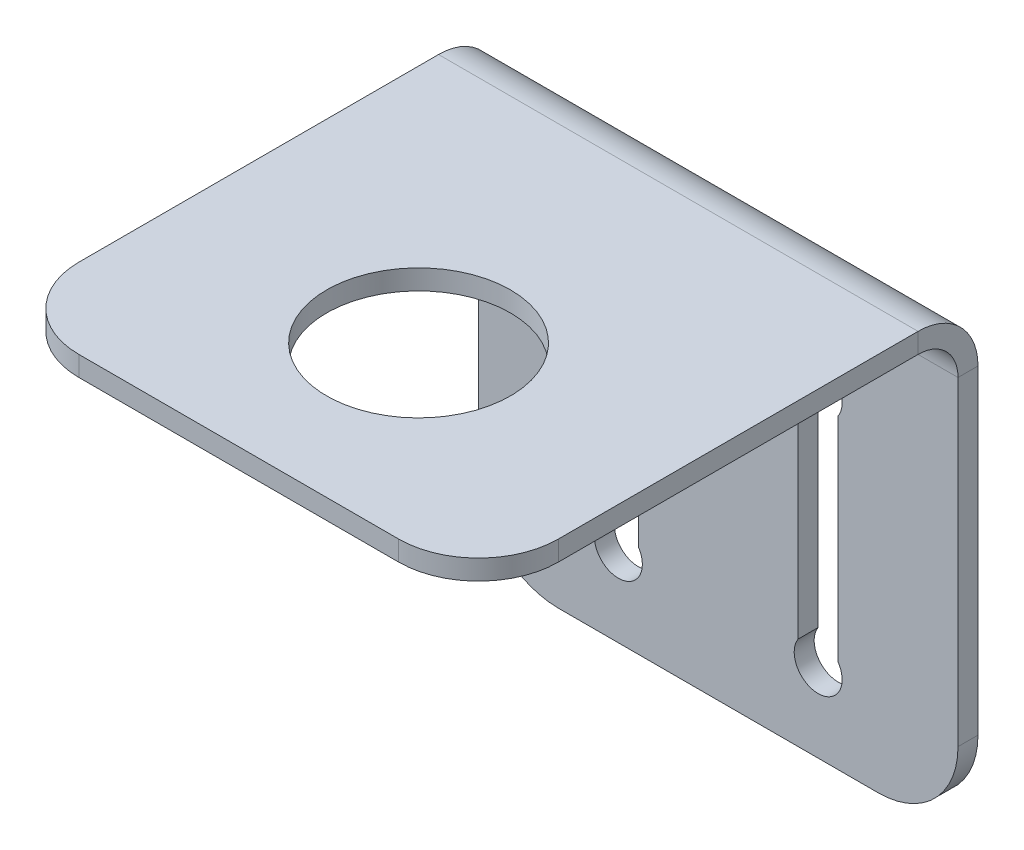
ISO-10303-21;
HEADER;
FILE_DESCRIPTION(('STEP AP214'),'2;1');
FILE_NAME('part.step','',(''),(''),'','','');
FILE_SCHEMA(('AUTOMOTIVE_DESIGN { 1 0 10303 214 1 1 1 1 }'));
ENDSEC;
DATA;
#1=APPLICATION_CONTEXT('core data for automotive mechanical design processes');
#2=APPLICATION_PROTOCOL_DEFINITION('international standard','automotive_design',2000,#1);
#3=PRODUCT_CONTEXT('',#1,'mechanical');
#4=PRODUCT('Part','Part','',(#3));
#5=PRODUCT_RELATED_PRODUCT_CATEGORY('part','',(#4));
#6=PRODUCT_DEFINITION_FORMATION('','',#4);
#7=PRODUCT_DEFINITION_CONTEXT('part definition',#1,'design');
#8=PRODUCT_DEFINITION('design','',#6,#7);
#9=PRODUCT_DEFINITION_SHAPE('','',#8);
#10=(LENGTH_UNIT() NAMED_UNIT(*) SI_UNIT(.MILLI.,.METRE.));
#11=(NAMED_UNIT(*) PLANE_ANGLE_UNIT() SI_UNIT($,.RADIAN.));
#12=(NAMED_UNIT(*) SI_UNIT($,.STERADIAN.) SOLID_ANGLE_UNIT());
#13=UNCERTAINTY_MEASURE_WITH_UNIT(LENGTH_MEASURE(1.E-05),#10,'distance_accuracy_value','');
#14=(GEOMETRIC_REPRESENTATION_CONTEXT(3) GLOBAL_UNCERTAINTY_ASSIGNED_CONTEXT((#13)) GLOBAL_UNIT_ASSIGNED_CONTEXT((#10,
#11,#12)) REPRESENTATION_CONTEXT('',''));
#15=CARTESIAN_POINT('',(0.,0.,0.));
#16=DIRECTION('',(0.,0.,1.));
#17=DIRECTION('',(1.,0.,0.));
#18=AXIS2_PLACEMENT_3D('',#15,#16,#17);
#19=CARTESIAN_POINT('',(60.,55.,65.));
#20=DIRECTION('',(1.,0.,0.));
#21=DIRECTION('',(0.,0.,-1.));
#22=AXIS2_PLACEMENT_3D('',#19,#20,#21);
#23=PLANE('',#22);
#24=DIRECTION('',(0.,0.,1.));
#25=VECTOR('',#24,1.);
#26=CARTESIAN_POINT('',(60.,57.5,65.));
#27=LINE('',#26,#25);
#28=CARTESIAN_POINT('',(60.,57.5,55.));
#29=VERTEX_POINT('',#28);
#30=CARTESIAN_POINT('',(60.,57.5,9.99999999999999));
#31=VERTEX_POINT('',#30);
#32=EDGE_CURVE('E292',#29,#31,#27,.F.);
#33=ORIENTED_EDGE('',*,*,#32,.F.);
#34=DIRECTION('',(0.,-1.,0.));
#35=VECTOR('',#34,1.);
#36=CARTESIAN_POINT('',(60.,55.,55.));
#37=LINE('',#36,#35);
#38=CARTESIAN_POINT('',(60.,55.,55.));
#39=VERTEX_POINT('',#38);
#40=EDGE_CURVE('E319',#29,#39,#37,.T.);
#41=ORIENTED_EDGE('',*,*,#40,.T.);
#42=DIRECTION('',(0.,0.,-1.));
#43=VECTOR('',#42,1.);
#44=CARTESIAN_POINT('',(60.,55.,65.));
#45=LINE('',#44,#43);
#46=CARTESIAN_POINT('',(60.,55.,9.99999999999999));
#47=VERTEX_POINT('',#46);
#48=EDGE_CURVE('E434',#39,#47,#45,.T.);
#49=ORIENTED_EDGE('',*,*,#48,.T.);
#50=DIRECTION('',(0.,-1.,0.));
#51=VECTOR('',#50,1.);
#52=CARTESIAN_POINT('',(60.,55.,9.99999999999999));
#53=LINE('',#52,#51);
#54=EDGE_CURVE('E316',#31,#47,#53,.T.);
#55=ORIENTED_EDGE('',*,*,#54,.F.);
#56=EDGE_LOOP('',(#33,#41,#49,#55));
#57=FACE_BOUND('',#56,.T.);
#58=ADVANCED_FACE('F49',(#57),#23,.T.);
#59=CARTESIAN_POINT('',(0.,55.,65.));
#60=DIRECTION('',(0.,0.,1.));
#61=DIRECTION('',(1.,0.,0.));
#62=AXIS2_PLACEMENT_3D('',#59,#60,#61);
#63=PLANE('',#62);
#64=DIRECTION('',(1.,0.,0.));
#65=VECTOR('',#64,1.);
#66=CARTESIAN_POINT('',(0.,57.5,65.));
#67=LINE('',#66,#65);
#68=CARTESIAN_POINT('',(10.,57.5,65.));
#69=VERTEX_POINT('',#68);
#70=CARTESIAN_POINT('',(50.,57.5,65.));
#71=VERTEX_POINT('',#70);
#72=EDGE_CURVE('E290',#69,#71,#67,.T.);
#73=ORIENTED_EDGE('',*,*,#72,.F.);
#74=DIRECTION('',(0.,1.,0.));
#75=VECTOR('',#74,1.);
#76=CARTESIAN_POINT('',(10.,55.,65.));
#77=LINE('',#76,#75);
#78=CARTESIAN_POINT('',(10.,55.,65.));
#79=VERTEX_POINT('',#78);
#80=EDGE_CURVE('E332',#69,#79,#77,.F.);
#81=ORIENTED_EDGE('',*,*,#80,.T.);
#82=DIRECTION('',(1.,0.,0.));
#83=VECTOR('',#82,1.);
#84=CARTESIAN_POINT('',(0.,55.,65.));
#85=LINE('',#84,#83);
#86=CARTESIAN_POINT('',(50.,55.,65.));
#87=VERTEX_POINT('',#86);
#88=EDGE_CURVE('E431',#79,#87,#85,.T.);
#89=ORIENTED_EDGE('',*,*,#88,.T.);
#90=DIRECTION('',(0.,-1.,0.));
#91=VECTOR('',#90,1.);
#92=CARTESIAN_POINT('',(50.,55.,65.));
#93=LINE('',#92,#91);
#94=EDGE_CURVE('E327',#87,#71,#93,.F.);
#95=ORIENTED_EDGE('',*,*,#94,.T.);
#96=EDGE_LOOP('',(#73,#81,#89,#95));
#97=FACE_BOUND('',#96,.T.);
#98=ADVANCED_FACE('F394',(#97),#63,.T.);
#99=CARTESIAN_POINT('',(0.,55.,65.));
#100=DIRECTION('',(1.,0.,0.));
#101=DIRECTION('',(0.,0.,-1.));
#102=AXIS2_PLACEMENT_3D('',#99,#100,#101);
#103=PLANE('',#102);
#104=DIRECTION('',(0.,0.,-1.));
#105=VECTOR('',#104,1.);
#106=CARTESIAN_POINT('',(0.,55.,65.));
#107=LINE('',#106,#105);
#108=CARTESIAN_POINT('',(0.,55.,55.));
#109=VERTEX_POINT('',#108);
#110=CARTESIAN_POINT('',(0.,55.,9.99999999999999));
#111=VERTEX_POINT('',#110);
#112=EDGE_CURVE('E207',#109,#111,#107,.T.);
#113=ORIENTED_EDGE('',*,*,#112,.F.);
#114=DIRECTION('',(0.,-1.,0.));
#115=VECTOR('',#114,1.);
#116=CARTESIAN_POINT('',(0.,55.,55.));
#117=LINE('',#116,#115);
#118=CARTESIAN_POINT('',(0.,57.5,55.));
#119=VERTEX_POINT('',#118);
#120=EDGE_CURVE('E337',#109,#119,#117,.F.);
#121=ORIENTED_EDGE('',*,*,#120,.T.);
#122=DIRECTION('',(0.,0.,1.));
#123=VECTOR('',#122,1.);
#124=CARTESIAN_POINT('',(0.,57.5,65.));
#125=LINE('',#124,#123);
#126=CARTESIAN_POINT('',(0.,57.5,9.99999999999999));
#127=VERTEX_POINT('',#126);
#128=EDGE_CURVE('E257',#119,#127,#125,.F.);
#129=ORIENTED_EDGE('',*,*,#128,.T.);
#130=DIRECTION('',(0.,-1.,0.));
#131=VECTOR('',#130,1.);
#132=CARTESIAN_POINT('',(0.,55.,9.99999999999999));
#133=LINE('',#132,#131);
#134=EDGE_CURVE('E313',#127,#111,#133,.T.);
#135=ORIENTED_EDGE('',*,*,#134,.T.);
#136=EDGE_LOOP('',(#113,#121,#129,#135));
#137=FACE_BOUND('',#136,.T.);
#138=ADVANCED_FACE('F400',(#137),#103,.F.);
#139=CARTESIAN_POINT('',(0.,50.,9.99999999999999));
#140=DIRECTION('',(-1.,0.,0.));
#141=DIRECTION('',(0.,-1.,0.));
#142=AXIS2_PLACEMENT_3D('',#139,#140,#141);
#143=PLANE('',#142);
#144=ORIENTED_EDGE('',*,*,#134,.F.);
#145=CARTESIAN_POINT('',(0.,50.,9.99999999999999));
#146=DIRECTION('',(-1.,0.,0.));
#147=DIRECTION('',(0.,0.,1.));
#148=AXIS2_PLACEMENT_3D('',#145,#146,#147);
#149=CIRCLE('',#148,7.5);
#150=CARTESIAN_POINT('',(0.,50.,2.5));
#151=VERTEX_POINT('',#150);
#152=EDGE_CURVE('E284',#127,#151,#149,.T.);
#153=ORIENTED_EDGE('',*,*,#152,.T.);
#154=DIRECTION('',(0.,0.,1.));
#155=VECTOR('',#154,1.);
#156=CARTESIAN_POINT('',(0.,50.,5.));
#157=LINE('',#156,#155);
#158=CARTESIAN_POINT('',(0.,50.,5.));
#159=VERTEX_POINT('',#158);
#160=EDGE_CURVE('E311',#151,#159,#157,.T.);
#161=ORIENTED_EDGE('',*,*,#160,.T.);
#162=CARTESIAN_POINT('',(0.,50.,9.99999999999999));
#163=DIRECTION('',(1.,0.,0.));
#164=DIRECTION('',(0.,1.,0.));
#165=AXIS2_PLACEMENT_3D('',#162,#163,#164);
#166=CIRCLE('',#165,5.);
#167=EDGE_CURVE('E244',#111,#159,#166,.F.);
#168=ORIENTED_EDGE('',*,*,#167,.F.);
#169=EDGE_LOOP('',(#144,#153,#161,#168));
#170=FACE_BOUND('',#169,.T.);
#171=ADVANCED_FACE('F376',(#170),#143,.T.);
#172=CARTESIAN_POINT('',(0.,0.,5.));
#173=DIRECTION('',(1.,0.,0.));
#174=DIRECTION('',(0.,-1.,0.));
#175=AXIS2_PLACEMENT_3D('',#172,#173,#174);
#176=PLANE('',#175);
#177=DIRECTION('',(0.,1.,0.));
#178=VECTOR('',#177,1.);
#179=CARTESIAN_POINT('',(0.,0.,2.5));
#180=LINE('',#179,#178);
#181=CARTESIAN_POINT('',(0.,9.99999999999999,2.5));
#182=VERTEX_POINT('',#181);
#183=EDGE_CURVE('E272',#151,#182,#180,.F.);
#184=ORIENTED_EDGE('',*,*,#183,.T.);
#185=DIRECTION('',(0.,0.,-1.));
#186=VECTOR('',#185,1.);
#187=CARTESIAN_POINT('',(0.,9.99999999999999,5.));
#188=LINE('',#187,#186);
#189=CARTESIAN_POINT('',(0.,9.99999999999999,5.));
#190=VERTEX_POINT('',#189);
#191=EDGE_CURVE('E341',#182,#190,#188,.F.);
#192=ORIENTED_EDGE('',*,*,#191,.T.);
#193=DIRECTION('',(0.,-1.,0.));
#194=VECTOR('',#193,1.);
#195=CARTESIAN_POINT('',(0.,0.,5.));
#196=LINE('',#195,#194);
#197=EDGE_CURVE('E229',#159,#190,#196,.T.);
#198=ORIENTED_EDGE('',*,*,#197,.F.);
#199=ORIENTED_EDGE('',*,*,#160,.F.);
#200=EDGE_LOOP('',(#184,#192,#198,#199));
#201=FACE_BOUND('',#200,.T.);
#202=ADVANCED_FACE('F367',(#201),#176,.F.);
#203=CARTESIAN_POINT('',(0.,0.,5.));
#204=DIRECTION('',(0.,1.,0.));
#205=DIRECTION('',(1.,0.,0.));
#206=AXIS2_PLACEMENT_3D('',#203,#204,#205);
#207=PLANE('',#206);
#208=DIRECTION('',(-1.,0.,0.));
#209=VECTOR('',#208,1.);
#210=CARTESIAN_POINT('',(0.,0.,2.5));
#211=LINE('',#210,#209);
#212=CARTESIAN_POINT('',(9.99999999999999,0.,2.5));
#213=VERTEX_POINT('',#212);
#214=CARTESIAN_POINT('',(50.,0.,2.5));
#215=VERTEX_POINT('',#214);
#216=EDGE_CURVE('E279',#213,#215,#211,.F.);
#217=ORIENTED_EDGE('',*,*,#216,.T.);
#218=DIRECTION('',(0.,0.,-1.));
#219=VECTOR('',#218,1.);
#220=CARTESIAN_POINT('',(50.,0.,5.));
#221=LINE('',#220,#219);
#222=CARTESIAN_POINT('',(50.,0.,5.));
#223=VERTEX_POINT('',#222);
#224=EDGE_CURVE('E350',#215,#223,#221,.F.);
#225=ORIENTED_EDGE('',*,*,#224,.T.);
#226=DIRECTION('',(1.,0.,0.));
#227=VECTOR('',#226,1.);
#228=CARTESIAN_POINT('',(0.,0.,5.));
#229=LINE('',#228,#227);
#230=CARTESIAN_POINT('',(9.99999999999999,0.,5.));
#231=VERTEX_POINT('',#230);
#232=EDGE_CURVE('E232',#231,#223,#229,.T.);
#233=ORIENTED_EDGE('',*,*,#232,.F.);
#234=DIRECTION('',(0.,0.,-1.));
#235=VECTOR('',#234,1.);
#236=CARTESIAN_POINT('',(9.99999999999999,0.,5.));
#237=LINE('',#236,#235);
#238=EDGE_CURVE('E346',#231,#213,#237,.T.);
#239=ORIENTED_EDGE('',*,*,#238,.T.);
#240=EDGE_LOOP('',(#217,#225,#233,#239));
#241=FACE_BOUND('',#240,.T.);
#242=ADVANCED_FACE('F356',(#241),#207,.F.);
#243=CARTESIAN_POINT('',(60.,0.,5.));
#244=DIRECTION('',(-1.,0.,0.));
#245=DIRECTION('',(0.,1.,0.));
#246=AXIS2_PLACEMENT_3D('',#243,#244,#245);
#247=PLANE('',#246);
#248=DIRECTION('',(0.,1.,0.));
#249=VECTOR('',#248,1.);
#250=CARTESIAN_POINT('',(60.,0.,5.));
#251=LINE('',#250,#249);
#252=CARTESIAN_POINT('',(60.,10.,5.));
#253=VERTEX_POINT('',#252);
#254=CARTESIAN_POINT('',(60.,50.,5.));
#255=VERTEX_POINT('',#254);
#256=EDGE_CURVE('E234',#253,#255,#251,.T.);
#257=ORIENTED_EDGE('',*,*,#256,.F.);
#258=DIRECTION('',(0.,0.,-1.));
#259=VECTOR('',#258,1.);
#260=CARTESIAN_POINT('',(60.,10.,5.));
#261=LINE('',#260,#259);
#262=CARTESIAN_POINT('',(60.,10.,2.5));
#263=VERTEX_POINT('',#262);
#264=EDGE_CURVE('E57',#253,#263,#261,.T.);
#265=ORIENTED_EDGE('',*,*,#264,.T.);
#266=DIRECTION('',(0.,1.,0.));
#267=VECTOR('',#266,1.);
#268=CARTESIAN_POINT('',(60.,0.,2.5));
#269=LINE('',#268,#267);
#270=CARTESIAN_POINT('',(60.,50.,2.5));
#271=VERTEX_POINT('',#270);
#272=EDGE_CURVE('E254',#263,#271,#269,.T.);
#273=ORIENTED_EDGE('',*,*,#272,.T.);
#274=DIRECTION('',(0.,0.,1.));
#275=VECTOR('',#274,1.);
#276=CARTESIAN_POINT('',(60.,50.,5.));
#277=LINE('',#276,#275);
#278=EDGE_CURVE('E309',#271,#255,#277,.T.);
#279=ORIENTED_EDGE('',*,*,#278,.T.);
#280=EDGE_LOOP('',(#257,#265,#273,#279));
#281=FACE_BOUND('',#280,.T.);
#282=ADVANCED_FACE('F387',(#281),#247,.F.);
#283=CARTESIAN_POINT('',(15.,38.3416876048223,5.));
#284=DIRECTION('',(1.,0.,0.));
#285=DIRECTION('',(0.,-1.,0.));
#286=AXIS2_PLACEMENT_3D('',#283,#284,#285);
#287=PLANE('',#286);
#288=DIRECTION('',(0.,0.,1.));
#289=VECTOR('',#288,1.);
#290=CARTESIAN_POINT('',(15.,11.6583123951777,5.));
#291=LINE('',#290,#289);
#292=CARTESIAN_POINT('',(15.,11.6583123951777,2.5));
#293=VERTEX_POINT('',#292);
#294=CARTESIAN_POINT('',(15.,11.6583123951777,5.));
#295=VERTEX_POINT('',#294);
#296=EDGE_CURVE('E307',#293,#295,#291,.T.);
#297=ORIENTED_EDGE('',*,*,#296,.F.);
#298=DIRECTION('',(0.,1.,0.));
#299=VECTOR('',#298,1.);
#300=CARTESIAN_POINT('',(15.,0.,2.5));
#301=LINE('',#300,#299);
#302=CARTESIAN_POINT('',(15.,38.3416876048223,2.5));
#303=VERTEX_POINT('',#302);
#304=EDGE_CURVE('E273',#303,#293,#301,.F.);
#305=ORIENTED_EDGE('',*,*,#304,.F.);
#306=DIRECTION('',(0.,0.,1.));
#307=VECTOR('',#306,1.);
#308=CARTESIAN_POINT('',(15.,38.3416876048223,5.));
#309=LINE('',#308,#307);
#310=CARTESIAN_POINT('',(15.,38.3416876048223,5.));
#311=VERTEX_POINT('',#310);
#312=EDGE_CURVE('E305',#303,#311,#309,.T.);
#313=ORIENTED_EDGE('',*,*,#312,.T.);
#314=DIRECTION('',(0.,-1.,0.));
#315=VECTOR('',#314,1.);
#316=CARTESIAN_POINT('',(15.,38.3416876048223,5.));
#317=LINE('',#316,#315);
#318=EDGE_CURVE('E223',#311,#295,#317,.T.);
#319=ORIENTED_EDGE('',*,*,#318,.T.);
#320=EDGE_LOOP('',(#297,#305,#313,#319));
#321=FACE_BOUND('',#320,.T.);
#322=ADVANCED_FACE('F482',(#321),#287,.T.);
#323=CARTESIAN_POINT('',(17.5,40.,5.));
#324=DIRECTION('',(0.,0.,-1.));
#325=DIRECTION('',(-1.,0.,0.));
#326=AXIS2_PLACEMENT_3D('',#323,#324,#325);
#327=CYLINDRICAL_SURFACE('',#326,3.);
#328=ORIENTED_EDGE('',*,*,#312,.F.);
#329=CARTESIAN_POINT('',(17.5,40.,2.5));
#330=DIRECTION('',(0.,0.,1.));
#331=DIRECTION('',(1.,0.,0.));
#332=AXIS2_PLACEMENT_3D('',#329,#330,#331);
#333=CIRCLE('',#332,3.);
#334=CARTESIAN_POINT('',(20.,38.3416876048223,2.5));
#335=VERTEX_POINT('',#334);
#336=EDGE_CURVE('E269',#335,#303,#333,.T.);
#337=ORIENTED_EDGE('',*,*,#336,.F.);
#338=DIRECTION('',(0.,0.,1.));
#339=VECTOR('',#338,1.);
#340=CARTESIAN_POINT('',(20.,38.3416876048223,5.));
#341=LINE('',#340,#339);
#342=CARTESIAN_POINT('',(20.,38.3416876048223,5.));
#343=VERTEX_POINT('',#342);
#344=EDGE_CURVE('E303',#335,#343,#341,.T.);
#345=ORIENTED_EDGE('',*,*,#344,.T.);
#346=CARTESIAN_POINT('',(17.5,40.,5.));
#347=DIRECTION('',(0.,0.,1.));
#348=DIRECTION('',(1.,0.,0.));
#349=AXIS2_PLACEMENT_3D('',#346,#347,#348);
#350=CIRCLE('',#349,3.);
#351=EDGE_CURVE('E226',#343,#311,#350,.T.);
#352=ORIENTED_EDGE('',*,*,#351,.T.);
#353=EDGE_LOOP('',(#328,#337,#345,#352));
#354=FACE_BOUND('',#353,.T.);
#355=ADVANCED_FACE('F478',(#354),#327,.F.);
#356=CARTESIAN_POINT('',(20.,38.3416876048223,5.));
#357=DIRECTION('',(-1.,0.,0.));
#358=DIRECTION('',(0.,1.,0.));
#359=AXIS2_PLACEMENT_3D('',#356,#357,#358);
#360=PLANE('',#359);
#361=ORIENTED_EDGE('',*,*,#344,.F.);
#362=DIRECTION('',(0.,1.,0.));
#363=VECTOR('',#362,1.);
#364=CARTESIAN_POINT('',(20.,0.,2.5));
#365=LINE('',#364,#363);
#366=CARTESIAN_POINT('',(20.,11.6583123951777,2.5));
#367=VERTEX_POINT('',#366);
#368=EDGE_CURVE('E261',#367,#335,#365,.T.);
#369=ORIENTED_EDGE('',*,*,#368,.F.);
#370=DIRECTION('',(0.,0.,1.));
#371=VECTOR('',#370,1.);
#372=CARTESIAN_POINT('',(20.,11.6583123951777,5.));
#373=LINE('',#372,#371);
#374=CARTESIAN_POINT('',(20.,11.6583123951777,5.));
#375=VERTEX_POINT('',#374);
#376=EDGE_CURVE('E301',#367,#375,#373,.T.);
#377=ORIENTED_EDGE('',*,*,#376,.T.);
#378=DIRECTION('',(0.,1.,0.));
#379=VECTOR('',#378,1.);
#380=CARTESIAN_POINT('',(20.,38.3416876048223,5.));
#381=LINE('',#380,#379);
#382=EDGE_CURVE('E217',#375,#343,#381,.T.);
#383=ORIENTED_EDGE('',*,*,#382,.T.);
#384=EDGE_LOOP('',(#361,#369,#377,#383));
#385=FACE_BOUND('',#384,.T.);
#386=ADVANCED_FACE('F472',(#385),#360,.T.);
#387=CARTESIAN_POINT('',(45.,38.3416876048223,5.));
#388=DIRECTION('',(-1.,0.,0.));
#389=DIRECTION('',(0.,1.,0.));
#390=AXIS2_PLACEMENT_3D('',#387,#388,#389);
#391=PLANE('',#390);
#392=DIRECTION('',(0.,0.,1.));
#393=VECTOR('',#392,1.);
#394=CARTESIAN_POINT('',(45.,38.3416876048223,5.));
#395=LINE('',#394,#393);
#396=CARTESIAN_POINT('',(45.,38.3416876048223,2.5));
#397=VERTEX_POINT('',#396);
#398=CARTESIAN_POINT('',(45.,38.3416876048223,5.));
#399=VERTEX_POINT('',#398);
#400=EDGE_CURVE('E210',#397,#399,#395,.T.);
#401=ORIENTED_EDGE('',*,*,#400,.F.);
#402=DIRECTION('',(0.,1.,0.));
#403=VECTOR('',#402,1.);
#404=CARTESIAN_POINT('',(45.,0.,2.5));
#405=LINE('',#404,#403);
#406=CARTESIAN_POINT('',(45.,11.6583123951777,2.5));
#407=VERTEX_POINT('',#406);
#408=EDGE_CURVE('E262',#407,#397,#405,.T.);
#409=ORIENTED_EDGE('',*,*,#408,.F.);
#410=DIRECTION('',(0.,0.,1.));
#411=VECTOR('',#410,1.);
#412=CARTESIAN_POINT('',(45.,11.6583123951777,5.));
#413=LINE('',#412,#411);
#414=CARTESIAN_POINT('',(45.,11.6583123951777,5.));
#415=VERTEX_POINT('',#414);
#416=EDGE_CURVE('E299',#407,#415,#413,.T.);
#417=ORIENTED_EDGE('',*,*,#416,.T.);
#418=DIRECTION('',(0.,1.,0.));
#419=VECTOR('',#418,1.);
#420=CARTESIAN_POINT('',(45.,38.3416876048223,5.));
#421=LINE('',#420,#419);
#422=EDGE_CURVE('E211',#415,#399,#421,.T.);
#423=ORIENTED_EDGE('',*,*,#422,.T.);
#424=EDGE_LOOP('',(#401,#409,#417,#423));
#425=FACE_BOUND('',#424,.T.);
#426=ADVANCED_FACE('F468',(#425),#391,.T.);
#427=CARTESIAN_POINT('',(42.5,10.,5.));
#428=DIRECTION('',(0.,0.,-1.));
#429=DIRECTION('',(-1.,0.,0.));
#430=AXIS2_PLACEMENT_3D('',#427,#428,#429);
#431=CYLINDRICAL_SURFACE('',#430,3.);
#432=ORIENTED_EDGE('',*,*,#416,.F.);
#433=CARTESIAN_POINT('',(42.5,10.,2.5));
#434=DIRECTION('',(0.,0.,1.));
#435=DIRECTION('',(1.,0.,0.));
#436=AXIS2_PLACEMENT_3D('',#433,#434,#435);
#437=CIRCLE('',#436,3.);
#438=CARTESIAN_POINT('',(40.,11.6583123951777,2.5));
#439=VERTEX_POINT('',#438);
#440=EDGE_CURVE('E258',#439,#407,#437,.T.);
#441=ORIENTED_EDGE('',*,*,#440,.F.);
#442=DIRECTION('',(0.,0.,1.));
#443=VECTOR('',#442,1.);
#444=CARTESIAN_POINT('',(40.,11.6583123951777,5.));
#445=LINE('',#444,#443);
#446=CARTESIAN_POINT('',(40.,11.6583123951777,5.));
#447=VERTEX_POINT('',#446);
#448=EDGE_CURVE('E195',#439,#447,#445,.T.);
#449=ORIENTED_EDGE('',*,*,#448,.T.);
#450=CARTESIAN_POINT('',(42.5,10.,5.));
#451=DIRECTION('',(0.,0.,1.));
#452=DIRECTION('',(1.,0.,0.));
#453=AXIS2_PLACEMENT_3D('',#450,#451,#452);
#454=CIRCLE('',#453,3.);
#455=EDGE_CURVE('E206',#447,#415,#454,.T.);
#456=ORIENTED_EDGE('',*,*,#455,.T.);
#457=EDGE_LOOP('',(#432,#441,#449,#456));
#458=FACE_BOUND('',#457,.T.);
#459=ADVANCED_FACE('F465',(#458),#431,.F.);
#460=CARTESIAN_POINT('',(40.,38.3416876048223,5.));
#461=DIRECTION('',(1.,0.,0.));
#462=DIRECTION('',(0.,-1.,0.));
#463=AXIS2_PLACEMENT_3D('',#460,#461,#462);
#464=PLANE('',#463);
#465=ORIENTED_EDGE('',*,*,#448,.F.);
#466=DIRECTION('',(0.,1.,0.));
#467=VECTOR('',#466,1.);
#468=CARTESIAN_POINT('',(40.,0.,2.5));
#469=LINE('',#468,#467);
#470=CARTESIAN_POINT('',(40.,38.3416876048223,2.5));
#471=VERTEX_POINT('',#470);
#472=EDGE_CURVE('E190',#471,#439,#469,.F.);
#473=ORIENTED_EDGE('',*,*,#472,.F.);
#474=DIRECTION('',(0.,0.,1.));
#475=VECTOR('',#474,1.);
#476=CARTESIAN_POINT('',(40.,38.3416876048223,5.));
#477=LINE('',#476,#475);
#478=CARTESIAN_POINT('',(40.,38.3416876048223,5.));
#479=VERTEX_POINT('',#478);
#480=EDGE_CURVE('E184',#471,#479,#477,.T.);
#481=ORIENTED_EDGE('',*,*,#480,.T.);
#482=DIRECTION('',(0.,-1.,0.));
#483=VECTOR('',#482,1.);
#484=CARTESIAN_POINT('',(40.,38.3416876048223,5.));
#485=LINE('',#484,#483);
#486=EDGE_CURVE('E187',#479,#447,#485,.T.);
#487=ORIENTED_EDGE('',*,*,#486,.T.);
#488=EDGE_LOOP('',(#465,#473,#481,#487));
#489=FACE_BOUND('',#488,.T.);
#490=ADVANCED_FACE('F186',(#489),#464,.T.);
#491=CARTESIAN_POINT('',(30.,55.,42.5));
#492=DIRECTION('',(0.,1.,0.));
#493=DIRECTION('',(0.,0.,1.));
#494=AXIS2_PLACEMENT_3D('',#491,#492,#493);
#495=CYLINDRICAL_SURFACE('',#494,11.5);
#496=CARTESIAN_POINT('',(30.,55.,42.5));
#497=DIRECTION('',(0.,-1.,0.));
#498=DIRECTION('',(0.,0.,-1.));
#499=AXIS2_PLACEMENT_3D('',#496,#497,#498);
#500=CIRCLE('',#499,11.5);
#501=CARTESIAN_POINT('',(30.,55.,31.));
#502=VERTEX_POINT('',#501);
#503=EDGE_CURVE('E248',#502,#502,#500,.T.);
#504=ORIENTED_EDGE('',*,*,#503,.T.);
#505=EDGE_LOOP('',(#504));
#506=FACE_BOUND('',#505,.T.);
#507=CARTESIAN_POINT('',(30.,57.5,42.5));
#508=DIRECTION('',(0.,-1.,0.));
#509=DIRECTION('',(0.,0.,-1.));
#510=AXIS2_PLACEMENT_3D('',#507,#508,#509);
#511=CIRCLE('',#510,11.5);
#512=CARTESIAN_POINT('',(30.,57.5,31.));
#513=VERTEX_POINT('',#512);
#514=EDGE_CURVE('E287',#513,#513,#511,.T.);
#515=ORIENTED_EDGE('',*,*,#514,.F.);
#516=EDGE_LOOP('',(#515));
#517=FACE_BOUND('',#516,.T.);
#518=ADVANCED_FACE('F409',(#506,#517),#495,.F.);
#519=CARTESIAN_POINT('',(42.5,40.,5.));
#520=DIRECTION('',(0.,0.,-1.));
#521=DIRECTION('',(-1.,0.,0.));
#522=AXIS2_PLACEMENT_3D('',#519,#520,#521);
#523=CYLINDRICAL_SURFACE('',#522,3.);
#524=CARTESIAN_POINT('',(42.5,40.,2.5));
#525=DIRECTION('',(0.,0.,1.));
#526=DIRECTION('',(1.,0.,0.));
#527=AXIS2_PLACEMENT_3D('',#524,#525,#526);
#528=CIRCLE('',#527,3.);
#529=EDGE_CURVE('E256',#397,#471,#528,.T.);
#530=ORIENTED_EDGE('',*,*,#529,.F.);
#531=ORIENTED_EDGE('',*,*,#400,.T.);
#532=CARTESIAN_POINT('',(42.5,40.,5.));
#533=DIRECTION('',(0.,0.,1.));
#534=DIRECTION('',(1.,0.,0.));
#535=AXIS2_PLACEMENT_3D('',#532,#533,#534);
#536=CIRCLE('',#535,3.);
#537=EDGE_CURVE('E203',#399,#479,#536,.T.);
#538=ORIENTED_EDGE('',*,*,#537,.T.);
#539=ORIENTED_EDGE('',*,*,#480,.F.);
#540=EDGE_LOOP('',(#530,#531,#538,#539));
#541=FACE_BOUND('',#540,.T.);
#542=ADVANCED_FACE('F209',(#541),#523,.F.);
#543=CARTESIAN_POINT('',(17.5,10.,5.));
#544=DIRECTION('',(0.,0.,-1.));
#545=DIRECTION('',(-1.,0.,0.));
#546=AXIS2_PLACEMENT_3D('',#543,#544,#545);
#547=CYLINDRICAL_SURFACE('',#546,3.);
#548=CARTESIAN_POINT('',(17.5,10.,2.5));
#549=DIRECTION('',(0.,0.,1.));
#550=DIRECTION('',(1.,0.,0.));
#551=AXIS2_PLACEMENT_3D('',#548,#549,#550);
#552=CIRCLE('',#551,3.);
#553=EDGE_CURVE('E268',#293,#367,#552,.T.);
#554=ORIENTED_EDGE('',*,*,#553,.F.);
#555=ORIENTED_EDGE('',*,*,#296,.T.);
#556=CARTESIAN_POINT('',(17.5,10.,5.));
#557=DIRECTION('',(0.,0.,1.));
#558=DIRECTION('',(1.,0.,0.));
#559=AXIS2_PLACEMENT_3D('',#556,#557,#558);
#560=CIRCLE('',#559,3.);
#561=EDGE_CURVE('E220',#295,#375,#560,.T.);
#562=ORIENTED_EDGE('',*,*,#561,.T.);
#563=ORIENTED_EDGE('',*,*,#376,.F.);
#564=EDGE_LOOP('',(#554,#555,#562,#563));
#565=FACE_BOUND('',#564,.T.);
#566=ADVANCED_FACE('F408',(#565),#547,.F.);
#567=CARTESIAN_POINT('',(60.,50.,9.99999999999999));
#568=DIRECTION('',(-1.,0.,0.));
#569=DIRECTION('',(0.,-1.,0.));
#570=AXIS2_PLACEMENT_3D('',#567,#568,#569);
#571=PLANE('',#570);
#572=CARTESIAN_POINT('',(60.,50.,9.99999999999999));
#573=DIRECTION('',(-1.,0.,0.));
#574=DIRECTION('',(0.,0.,1.));
#575=AXIS2_PLACEMENT_3D('',#572,#573,#574);
#576=CIRCLE('',#575,7.5);
#577=EDGE_CURVE('E288',#271,#31,#576,.F.);
#578=ORIENTED_EDGE('',*,*,#577,.T.);
#579=ORIENTED_EDGE('',*,*,#54,.T.);
#580=CARTESIAN_POINT('',(60.,50.,9.99999999999999));
#581=DIRECTION('',(1.,0.,0.));
#582=DIRECTION('',(0.,1.,0.));
#583=AXIS2_PLACEMENT_3D('',#580,#581,#582);
#584=CIRCLE('',#583,5.);
#585=EDGE_CURVE('E241',#255,#47,#584,.T.);
#586=ORIENTED_EDGE('',*,*,#585,.F.);
#587=ORIENTED_EDGE('',*,*,#278,.F.);
#588=EDGE_LOOP('',(#578,#579,#586,#587));
#589=FACE_BOUND('',#588,.T.);
#590=ADVANCED_FACE('F383',(#589),#571,.F.);
#591=CARTESIAN_POINT('',(0.,0.,5.));
#592=DIRECTION('',(0.,0.,-1.));
#593=DIRECTION('',(-1.,0.,0.));
#594=AXIS2_PLACEMENT_3D('',#591,#592,#593);
#595=PLANE('',#594);
#596=ORIENTED_EDGE('',*,*,#486,.F.);
#597=ORIENTED_EDGE('',*,*,#537,.F.);
#598=ORIENTED_EDGE('',*,*,#422,.F.);
#599=ORIENTED_EDGE('',*,*,#455,.F.);
#600=EDGE_LOOP('',(#596,#597,#598,#599));
#601=FACE_BOUND('',#600,.T.);
#602=ORIENTED_EDGE('',*,*,#382,.F.);
#603=ORIENTED_EDGE('',*,*,#561,.F.);
#604=ORIENTED_EDGE('',*,*,#318,.F.);
#605=ORIENTED_EDGE('',*,*,#351,.F.);
#606=EDGE_LOOP('',(#602,#603,#604,#605));
#607=FACE_BOUND('',#606,.T.);
#608=ORIENTED_EDGE('',*,*,#232,.T.);
#609=CARTESIAN_POINT('',(50.,10.,5.));
#610=DIRECTION('',(0.,0.,-1.));
#611=DIRECTION('',(-1.,0.,0.));
#612=AXIS2_PLACEMENT_3D('',#609,#610,#611);
#613=CIRCLE('',#612,10.);
#614=EDGE_CURVE('E71',#223,#253,#613,.F.);
#615=ORIENTED_EDGE('',*,*,#614,.T.);
#616=ORIENTED_EDGE('',*,*,#256,.T.);
#617=DIRECTION('',(1.,0.,0.));
#618=VECTOR('',#617,1.);
#619=CARTESIAN_POINT('',(0.,50.,5.));
#620=LINE('',#619,#618);
#621=EDGE_CURVE('E196',#255,#159,#620,.F.);
#622=ORIENTED_EDGE('',*,*,#621,.T.);
#623=ORIENTED_EDGE('',*,*,#197,.T.);
#624=CARTESIAN_POINT('',(9.99999999999999,10.,5.));
#625=DIRECTION('',(0.,0.,-1.));
#626=DIRECTION('',(-1.,0.,0.));
#627=AXIS2_PLACEMENT_3D('',#624,#625,#626);
#628=CIRCLE('',#627,10.);
#629=EDGE_CURVE('E344',#190,#231,#628,.F.);
#630=ORIENTED_EDGE('',*,*,#629,.T.);
#631=EDGE_LOOP('',(#608,#615,#616,#622,#623,#630));
#632=FACE_BOUND('',#631,.T.);
#633=ADVANCED_FACE('F200',(#601,#607,#632),#595,.F.);
#634=CARTESIAN_POINT('',(0.,55.,65.));
#635=DIRECTION('',(0.,1.,0.));
#636=DIRECTION('',(0.,0.,1.));
#637=AXIS2_PLACEMENT_3D('',#634,#635,#636);
#638=PLANE('',#637);
#639=ORIENTED_EDGE('',*,*,#503,.F.);
#640=EDGE_LOOP('',(#639));
#641=FACE_BOUND('',#640,.T.);
#642=ORIENTED_EDGE('',*,*,#88,.F.);
#643=CARTESIAN_POINT('',(10.,55.,55.));
#644=DIRECTION('',(0.,1.,0.));
#645=DIRECTION('',(0.,0.,1.));
#646=AXIS2_PLACEMENT_3D('',#643,#644,#645);
#647=CIRCLE('',#646,10.);
#648=EDGE_CURVE('E335',#79,#109,#647,.F.);
#649=ORIENTED_EDGE('',*,*,#648,.T.);
#650=ORIENTED_EDGE('',*,*,#112,.T.);
#651=DIRECTION('',(1.,0.,0.));
#652=VECTOR('',#651,1.);
#653=CARTESIAN_POINT('',(60.,55.,9.99999999999999));
#654=LINE('',#653,#652);
#655=EDGE_CURVE('E236',#111,#47,#654,.T.);
#656=ORIENTED_EDGE('',*,*,#655,.T.);
#657=ORIENTED_EDGE('',*,*,#48,.F.);
#658=CARTESIAN_POINT('',(50.,55.,55.));
#659=DIRECTION('',(0.,1.,0.));
#660=DIRECTION('',(0.,0.,1.));
#661=AXIS2_PLACEMENT_3D('',#658,#659,#660);
#662=CIRCLE('',#661,10.);
#663=EDGE_CURVE('E324',#39,#87,#662,.F.);
#664=ORIENTED_EDGE('',*,*,#663,.T.);
#665=EDGE_LOOP('',(#642,#649,#650,#656,#657,#664));
#666=FACE_BOUND('',#665,.T.);
#667=ADVANCED_FACE('F441',(#641,#666),#638,.F.);
#668=CARTESIAN_POINT('',(0.,50.,9.99999999999999));
#669=DIRECTION('',(-1.,0.,0.));
#670=DIRECTION('',(0.,0.,1.));
#671=AXIS2_PLACEMENT_3D('',#668,#669,#670);
#672=CYLINDRICAL_SURFACE('',#671,5.);
#673=ORIENTED_EDGE('',*,*,#167,.T.);
#674=ORIENTED_EDGE('',*,*,#621,.F.);
#675=ORIENTED_EDGE('',*,*,#585,.T.);
#676=ORIENTED_EDGE('',*,*,#655,.F.);
#677=EDGE_LOOP('',(#673,#674,#675,#676));
#678=FACE_BOUND('',#677,.T.);
#679=ADVANCED_FACE('F445',(#678),#672,.F.);
#680=CARTESIAN_POINT('',(0.,0.,2.5));
#681=DIRECTION('',(0.,0.,-1.));
#682=DIRECTION('',(-1.,0.,0.));
#683=AXIS2_PLACEMENT_3D('',#680,#681,#682);
#684=PLANE('',#683);
#685=ORIENTED_EDGE('',*,*,#472,.T.);
#686=ORIENTED_EDGE('',*,*,#440,.T.);
#687=ORIENTED_EDGE('',*,*,#408,.T.);
#688=ORIENTED_EDGE('',*,*,#529,.T.);
#689=EDGE_LOOP('',(#685,#686,#687,#688));
#690=FACE_BOUND('',#689,.T.);
#691=ORIENTED_EDGE('',*,*,#368,.T.);
#692=ORIENTED_EDGE('',*,*,#336,.T.);
#693=ORIENTED_EDGE('',*,*,#304,.T.);
#694=ORIENTED_EDGE('',*,*,#553,.T.);
#695=EDGE_LOOP('',(#691,#692,#693,#694));
#696=FACE_BOUND('',#695,.T.);
#697=ORIENTED_EDGE('',*,*,#272,.F.);
#698=CARTESIAN_POINT('',(50.,10.,2.5));
#699=DIRECTION('',(0.,0.,-1.));
#700=DIRECTION('',(-1.,0.,0.));
#701=AXIS2_PLACEMENT_3D('',#698,#699,#700);
#702=CIRCLE('',#701,10.);
#703=EDGE_CURVE('E13',#263,#215,#702,.T.);
#704=ORIENTED_EDGE('',*,*,#703,.T.);
#705=ORIENTED_EDGE('',*,*,#216,.F.);
#706=CARTESIAN_POINT('',(9.99999999999999,10.,2.5));
#707=DIRECTION('',(0.,0.,-1.));
#708=DIRECTION('',(-1.,0.,0.));
#709=AXIS2_PLACEMENT_3D('',#706,#707,#708);
#710=CIRCLE('',#709,10.);
#711=EDGE_CURVE('E348',#213,#182,#710,.T.);
#712=ORIENTED_EDGE('',*,*,#711,.T.);
#713=ORIENTED_EDGE('',*,*,#183,.F.);
#714=DIRECTION('',(-1.,0.,0.));
#715=VECTOR('',#714,1.);
#716=CARTESIAN_POINT('',(0.,50.,2.5));
#717=LINE('',#716,#715);
#718=EDGE_CURVE('E245',#271,#151,#717,.T.);
#719=ORIENTED_EDGE('',*,*,#718,.F.);
#720=EDGE_LOOP('',(#697,#704,#705,#712,#713,#719));
#721=FACE_BOUND('',#720,.T.);
#722=ADVANCED_FACE('F371',(#690,#696,#721),#684,.T.);
#723=CARTESIAN_POINT('',(0.,57.5,65.));
#724=DIRECTION('',(0.,1.,0.));
#725=DIRECTION('',(0.,0.,1.));
#726=AXIS2_PLACEMENT_3D('',#723,#724,#725);
#727=PLANE('',#726);
#728=ORIENTED_EDGE('',*,*,#514,.T.);
#729=EDGE_LOOP('',(#728));
#730=FACE_BOUND('',#729,.T.);
#731=ORIENTED_EDGE('',*,*,#128,.F.);
#732=CARTESIAN_POINT('',(10.,57.5,55.));
#733=DIRECTION('',(0.,1.,0.));
#734=DIRECTION('',(0.,0.,1.));
#735=AXIS2_PLACEMENT_3D('',#732,#733,#734);
#736=CIRCLE('',#735,10.);
#737=EDGE_CURVE('E339',#119,#69,#736,.T.);
#738=ORIENTED_EDGE('',*,*,#737,.T.);
#739=ORIENTED_EDGE('',*,*,#72,.T.);
#740=CARTESIAN_POINT('',(50.,57.5,55.));
#741=DIRECTION('',(0.,1.,0.));
#742=DIRECTION('',(0.,0.,1.));
#743=AXIS2_PLACEMENT_3D('',#740,#741,#742);
#744=CIRCLE('',#743,10.);
#745=EDGE_CURVE('E330',#71,#29,#744,.T.);
#746=ORIENTED_EDGE('',*,*,#745,.T.);
#747=ORIENTED_EDGE('',*,*,#32,.T.);
#748=DIRECTION('',(1.,0.,0.));
#749=VECTOR('',#748,1.);
#750=CARTESIAN_POINT('',(0.,57.5,9.99999999999999));
#751=LINE('',#750,#749);
#752=EDGE_CURVE('E251',#127,#31,#751,.T.);
#753=ORIENTED_EDGE('',*,*,#752,.F.);
#754=EDGE_LOOP('',(#731,#738,#739,#746,#747,#753));
#755=FACE_BOUND('',#754,.T.);
#756=ADVANCED_FACE('F427',(#730,#755),#727,.T.);
#757=CARTESIAN_POINT('',(0.,50.,9.99999999999999));
#758=DIRECTION('',(-1.,0.,0.));
#759=DIRECTION('',(0.,0.,1.));
#760=AXIS2_PLACEMENT_3D('',#757,#758,#759);
#761=CYLINDRICAL_SURFACE('',#760,7.5);
#762=ORIENTED_EDGE('',*,*,#152,.F.);
#763=ORIENTED_EDGE('',*,*,#752,.T.);
#764=ORIENTED_EDGE('',*,*,#577,.F.);
#765=ORIENTED_EDGE('',*,*,#718,.T.);
#766=EDGE_LOOP('',(#762,#763,#764,#765));
#767=FACE_BOUND('',#766,.T.);
#768=ADVANCED_FACE('F380',(#767),#761,.T.);
#769=CARTESIAN_POINT('',(50.,55.,55.));
#770=DIRECTION('',(0.,-1.,0.));
#771=DIRECTION('',(0.,0.,-1.));
#772=AXIS2_PLACEMENT_3D('',#769,#770,#771);
#773=CYLINDRICAL_SURFACE('',#772,10.);
#774=ORIENTED_EDGE('',*,*,#745,.F.);
#775=ORIENTED_EDGE('',*,*,#94,.F.);
#776=ORIENTED_EDGE('',*,*,#663,.F.);
#777=ORIENTED_EDGE('',*,*,#40,.F.);
#778=EDGE_LOOP('',(#774,#775,#776,#777));
#779=FACE_BOUND('',#778,.T.);
#780=ADVANCED_FACE('F413',(#779),#773,.T.);
#781=CARTESIAN_POINT('',(10.,55.,55.));
#782=DIRECTION('',(0.,1.,0.));
#783=DIRECTION('',(0.,0.,1.));
#784=AXIS2_PLACEMENT_3D('',#781,#782,#783);
#785=CYLINDRICAL_SURFACE('',#784,10.);
#786=ORIENTED_EDGE('',*,*,#737,.F.);
#787=ORIENTED_EDGE('',*,*,#120,.F.);
#788=ORIENTED_EDGE('',*,*,#648,.F.);
#789=ORIENTED_EDGE('',*,*,#80,.F.);
#790=EDGE_LOOP('',(#786,#787,#788,#789));
#791=FACE_BOUND('',#790,.T.);
#792=ADVANCED_FACE('F392',(#791),#785,.T.);
#793=CARTESIAN_POINT('',(9.99999999999999,10.,5.));
#794=DIRECTION('',(0.,0.,1.));
#795=DIRECTION('',(1.,0.,0.));
#796=AXIS2_PLACEMENT_3D('',#793,#794,#795);
#797=CYLINDRICAL_SURFACE('',#796,10.);
#798=ORIENTED_EDGE('',*,*,#711,.F.);
#799=ORIENTED_EDGE('',*,*,#238,.F.);
#800=ORIENTED_EDGE('',*,*,#629,.F.);
#801=ORIENTED_EDGE('',*,*,#191,.F.);
#802=EDGE_LOOP('',(#798,#799,#800,#801));
#803=FACE_BOUND('',#802,.T.);
#804=ADVANCED_FACE('F365',(#803),#797,.T.);
#805=CARTESIAN_POINT('',(50.,10.,5.));
#806=DIRECTION('',(0.,0.,1.));
#807=DIRECTION('',(1.,0.,0.));
#808=AXIS2_PLACEMENT_3D('',#805,#806,#807);
#809=CYLINDRICAL_SURFACE('',#808,10.);
#810=ORIENTED_EDGE('',*,*,#703,.F.);
#811=ORIENTED_EDGE('',*,*,#264,.F.);
#812=ORIENTED_EDGE('',*,*,#614,.F.);
#813=ORIENTED_EDGE('',*,*,#224,.F.);
#814=EDGE_LOOP('',(#810,#811,#812,#813));
#815=FACE_BOUND('',#814,.T.);
#816=ADVANCED_FACE('F51',(#815),#809,.T.);
#817=CLOSED_SHELL('',(#58,#98,#138,#171,#202,#242,#282,#322,#355,#386,#426,#459,#490,#518,#542,
#566,#590,#633,#667,#679,#722,#756,#768,#780,#792,#804,#816));
#818=MANIFOLD_SOLID_BREP('B2',#817);
#819=ADVANCED_BREP_SHAPE_REPRESENTATION('',(#18,#818),#14);
#820=SHAPE_DEFINITION_REPRESENTATION(#9,#819);
ENDSEC;
END-ISO-10303-21;
